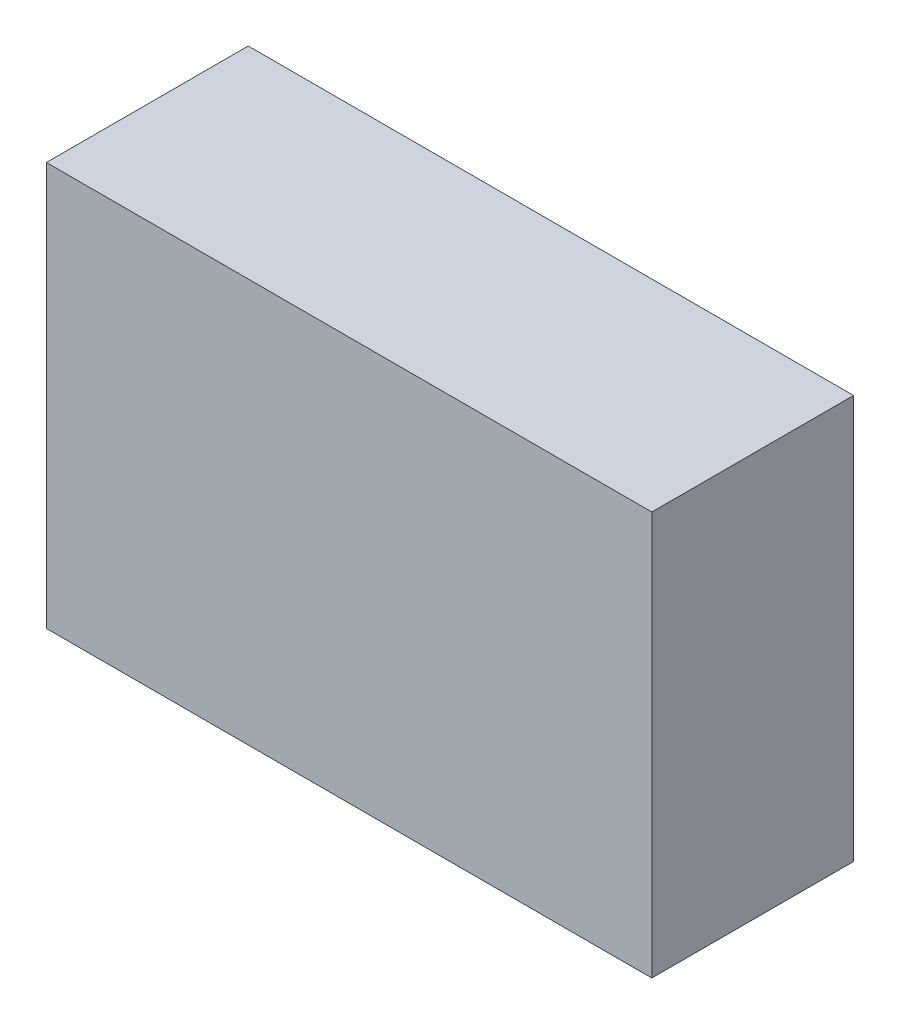
ISO-10303-21;
HEADER;
FILE_DESCRIPTION(('STEP AP214'),'2;1');
FILE_NAME('part.step','',(''),(''),'','','');
FILE_SCHEMA(('AUTOMOTIVE_DESIGN { 1 0 10303 214 1 1 1 1 }'));
ENDSEC;
DATA;
#1=APPLICATION_CONTEXT('core data for automotive mechanical design processes');
#2=APPLICATION_PROTOCOL_DEFINITION('international standard','automotive_design',2000,#1);
#3=PRODUCT_CONTEXT('',#1,'mechanical');
#4=PRODUCT('Part','Part','',(#3));
#5=PRODUCT_RELATED_PRODUCT_CATEGORY('part','',(#4));
#6=PRODUCT_DEFINITION_FORMATION('','',#4);
#7=PRODUCT_DEFINITION_CONTEXT('part definition',#1,'design');
#8=PRODUCT_DEFINITION('design','',#6,#7);
#9=PRODUCT_DEFINITION_SHAPE('','',#8);
#10=(LENGTH_UNIT() NAMED_UNIT(*) SI_UNIT(.MILLI.,.METRE.));
#11=(NAMED_UNIT(*) PLANE_ANGLE_UNIT() SI_UNIT($,.RADIAN.));
#12=(NAMED_UNIT(*) SI_UNIT($,.STERADIAN.) SOLID_ANGLE_UNIT());
#13=UNCERTAINTY_MEASURE_WITH_UNIT(LENGTH_MEASURE(1.E-05),#10,'distance_accuracy_value','');
#14=(GEOMETRIC_REPRESENTATION_CONTEXT(3) GLOBAL_UNCERTAINTY_ASSIGNED_CONTEXT((#13)) GLOBAL_UNIT_ASSIGNED_CONTEXT((#10,
#11,#12)) REPRESENTATION_CONTEXT('',''));
#15=CARTESIAN_POINT('',(0.,0.,0.));
#16=DIRECTION('',(0.,0.,1.));
#17=DIRECTION('',(1.,0.,0.));
#18=AXIS2_PLACEMENT_3D('',#15,#16,#17);
#19=CARTESIAN_POINT('',(-150.,100.,100.));
#20=DIRECTION('',(1.,0.,0.));
#21=DIRECTION('',(0.,0.,-1.));
#22=AXIS2_PLACEMENT_3D('',#19,#20,#21);
#23=PLANE('',#22);
#24=DIRECTION('',(0.,-1.,0.));
#25=VECTOR('',#24,1.);
#26=CARTESIAN_POINT('',(-150.,100.,0.));
#27=LINE('',#26,#25);
#28=CARTESIAN_POINT('',(-150.,100.,0.));
#29=VERTEX_POINT('',#28);
#30=CARTESIAN_POINT('',(-150.,-100.,0.));
#31=VERTEX_POINT('',#30);
#32=EDGE_CURVE('E93',#29,#31,#27,.T.);
#33=ORIENTED_EDGE('',*,*,#32,.T.);
#34=DIRECTION('',(0.,0.,-1.));
#35=VECTOR('',#34,1.);
#36=CARTESIAN_POINT('',(-150.,-100.,100.));
#37=LINE('',#36,#35);
#38=CARTESIAN_POINT('',(-150.,-100.,100.));
#39=VERTEX_POINT('',#38);
#40=EDGE_CURVE('E11',#39,#31,#37,.T.);
#41=ORIENTED_EDGE('',*,*,#40,.F.);
#42=DIRECTION('',(0.,-1.,0.));
#43=VECTOR('',#42,1.);
#44=CARTESIAN_POINT('',(-150.,100.,100.));
#45=LINE('',#44,#43);
#46=CARTESIAN_POINT('',(-150.,100.,100.));
#47=VERTEX_POINT('',#46);
#48=EDGE_CURVE('E81',#47,#39,#45,.T.);
#49=ORIENTED_EDGE('',*,*,#48,.F.);
#50=DIRECTION('',(0.,0.,-1.));
#51=VECTOR('',#50,1.);
#52=CARTESIAN_POINT('',(-150.,100.,100.));
#53=LINE('',#52,#51);
#54=EDGE_CURVE('E89',#47,#29,#53,.T.);
#55=ORIENTED_EDGE('',*,*,#54,.T.);
#56=EDGE_LOOP('',(#33,#41,#49,#55));
#57=FACE_BOUND('',#56,.T.);
#58=ADVANCED_FACE('F30',(#57),#23,.F.);
#59=CARTESIAN_POINT('',(-150.,-100.,100.));
#60=DIRECTION('',(0.,1.,0.));
#61=DIRECTION('',(0.,0.,1.));
#62=AXIS2_PLACEMENT_3D('',#59,#60,#61);
#63=PLANE('',#62);
#64=DIRECTION('',(1.,0.,0.));
#65=VECTOR('',#64,1.);
#66=CARTESIAN_POINT('',(-150.,-100.,0.));
#67=LINE('',#66,#65);
#68=CARTESIAN_POINT('',(150.,-100.,0.));
#69=VERTEX_POINT('',#68);
#70=EDGE_CURVE('E85',#31,#69,#67,.T.);
#71=ORIENTED_EDGE('',*,*,#70,.T.);
#72=DIRECTION('',(0.,0.,-1.));
#73=VECTOR('',#72,1.);
#74=CARTESIAN_POINT('',(150.,-100.,100.));
#75=LINE('',#74,#73);
#76=CARTESIAN_POINT('',(150.,-100.,100.));
#77=VERTEX_POINT('',#76);
#78=EDGE_CURVE('E38',#77,#69,#75,.T.);
#79=ORIENTED_EDGE('',*,*,#78,.F.);
#80=DIRECTION('',(1.,0.,0.));
#81=VECTOR('',#80,1.);
#82=CARTESIAN_POINT('',(-150.,-100.,100.));
#83=LINE('',#82,#81);
#84=EDGE_CURVE('E76',#39,#77,#83,.T.);
#85=ORIENTED_EDGE('',*,*,#84,.F.);
#86=ORIENTED_EDGE('',*,*,#40,.T.);
#87=EDGE_LOOP('',(#71,#79,#85,#86));
#88=FACE_BOUND('',#87,.T.);
#89=ADVANCED_FACE('F84',(#88),#63,.F.);
#90=CARTESIAN_POINT('',(150.,100.,100.));
#91=DIRECTION('',(-1.,0.,0.));
#92=DIRECTION('',(0.,0.,1.));
#93=AXIS2_PLACEMENT_3D('',#90,#91,#92);
#94=PLANE('',#93);
#95=DIRECTION('',(0.,1.,0.));
#96=VECTOR('',#95,1.);
#97=CARTESIAN_POINT('',(150.,100.,0.));
#98=LINE('',#97,#96);
#99=CARTESIAN_POINT('',(150.,100.,0.));
#100=VERTEX_POINT('',#99);
#101=EDGE_CURVE('E63',#69,#100,#98,.T.);
#102=ORIENTED_EDGE('',*,*,#101,.T.);
#103=DIRECTION('',(0.,0.,-1.));
#104=VECTOR('',#103,1.);
#105=CARTESIAN_POINT('',(150.,100.,100.));
#106=LINE('',#105,#104);
#107=CARTESIAN_POINT('',(150.,100.,100.));
#108=VERTEX_POINT('',#107);
#109=EDGE_CURVE('E86',#108,#100,#106,.T.);
#110=ORIENTED_EDGE('',*,*,#109,.F.);
#111=DIRECTION('',(0.,1.,0.));
#112=VECTOR('',#111,1.);
#113=CARTESIAN_POINT('',(150.,100.,100.));
#114=LINE('',#113,#112);
#115=EDGE_CURVE('E79',#77,#108,#114,.T.);
#116=ORIENTED_EDGE('',*,*,#115,.F.);
#117=ORIENTED_EDGE('',*,*,#78,.T.);
#118=EDGE_LOOP('',(#102,#110,#116,#117));
#119=FACE_BOUND('',#118,.T.);
#120=ADVANCED_FACE('F87',(#119),#94,.F.);
#121=CARTESIAN_POINT('',(-150.,100.,100.));
#122=DIRECTION('',(0.,-1.,0.));
#123=DIRECTION('',(0.,0.,-1.));
#124=AXIS2_PLACEMENT_3D('',#121,#122,#123);
#125=PLANE('',#124);
#126=DIRECTION('',(-1.,0.,0.));
#127=VECTOR('',#126,1.);
#128=CARTESIAN_POINT('',(-150.,100.,0.));
#129=LINE('',#128,#127);
#130=EDGE_CURVE('E69',#100,#29,#129,.T.);
#131=ORIENTED_EDGE('',*,*,#130,.T.);
#132=ORIENTED_EDGE('',*,*,#54,.F.);
#133=DIRECTION('',(-1.,0.,0.));
#134=VECTOR('',#133,1.);
#135=CARTESIAN_POINT('',(-150.,100.,100.));
#136=LINE('',#135,#134);
#137=EDGE_CURVE('E46',#108,#47,#136,.T.);
#138=ORIENTED_EDGE('',*,*,#137,.F.);
#139=ORIENTED_EDGE('',*,*,#109,.T.);
#140=EDGE_LOOP('',(#131,#132,#138,#139));
#141=FACE_BOUND('',#140,.T.);
#142=ADVANCED_FACE('F100',(#141),#125,.F.);
#143=CARTESIAN_POINT('',(-150.,-100.,100.));
#144=DIRECTION('',(0.,0.,1.));
#145=DIRECTION('',(1.,0.,0.));
#146=AXIS2_PLACEMENT_3D('',#143,#144,#145);
#147=PLANE('',#146);
#148=ORIENTED_EDGE('',*,*,#48,.T.);
#149=ORIENTED_EDGE('',*,*,#84,.T.);
#150=ORIENTED_EDGE('',*,*,#115,.T.);
#151=ORIENTED_EDGE('',*,*,#137,.T.);
#152=EDGE_LOOP('',(#148,#149,#150,#151));
#153=FACE_BOUND('',#152,.T.);
#154=ADVANCED_FACE('F77',(#153),#147,.T.);
#155=CARTESIAN_POINT('',(-150.,-100.,0.));
#156=DIRECTION('',(0.,0.,1.));
#157=DIRECTION('',(1.,0.,0.));
#158=AXIS2_PLACEMENT_3D('',#155,#156,#157);
#159=PLANE('',#158);
#160=ORIENTED_EDGE('',*,*,#32,.F.);
#161=ORIENTED_EDGE('',*,*,#130,.F.);
#162=ORIENTED_EDGE('',*,*,#101,.F.);
#163=ORIENTED_EDGE('',*,*,#70,.F.);
#164=EDGE_LOOP('',(#160,#161,#162,#163));
#165=FACE_BOUND('',#164,.T.);
#166=ADVANCED_FACE('F103',(#165),#159,.F.);
#167=CLOSED_SHELL('',(#58,#89,#120,#142,#154,#166));
#168=MANIFOLD_SOLID_BREP('B2',#167);
#169=ADVANCED_BREP_SHAPE_REPRESENTATION('',(#18,#168),#14);
#170=SHAPE_DEFINITION_REPRESENTATION(#9,#169);
ENDSEC;
END-ISO-10303-21;
